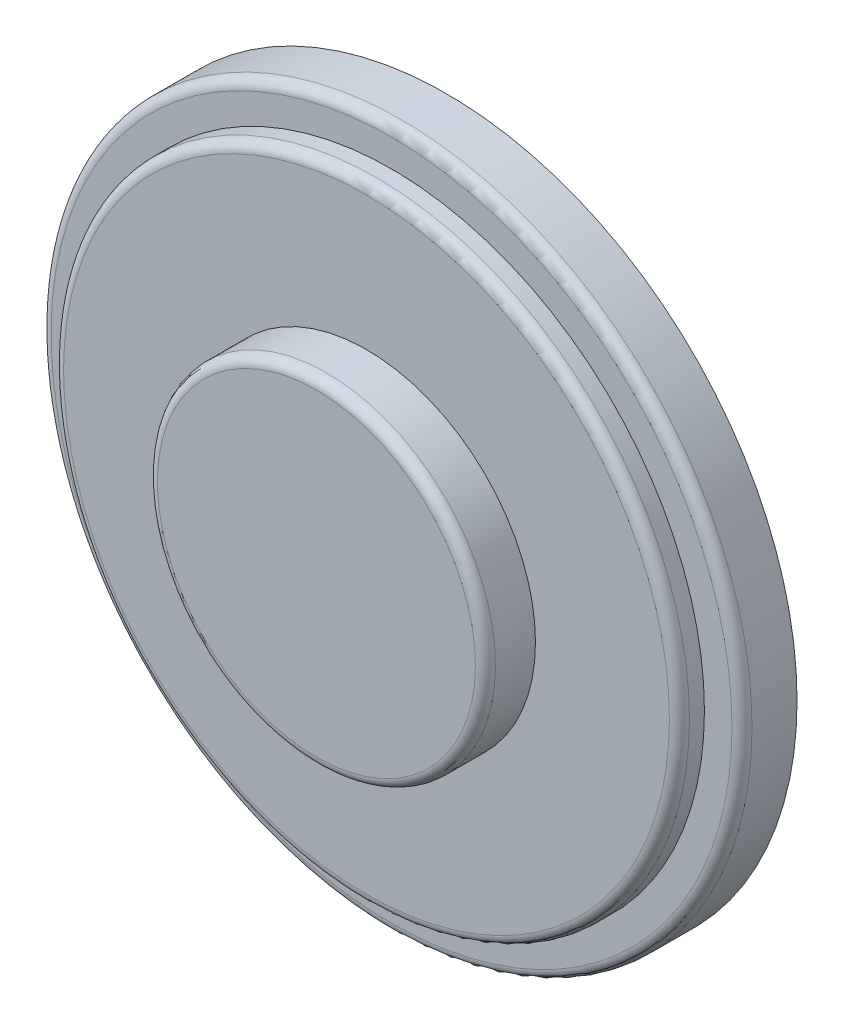
ISO-10303-21;
HEADER;
FILE_DESCRIPTION(('STEP AP214'),'2;1');
FILE_NAME('part.step','',(''),(''),'','','');
FILE_SCHEMA(('AUTOMOTIVE_DESIGN { 1 0 10303 214 1 1 1 1 }'));
ENDSEC;
DATA;
#1=APPLICATION_CONTEXT('core data for automotive mechanical design processes');
#2=APPLICATION_PROTOCOL_DEFINITION('international standard','automotive_design',2000,#1);
#3=PRODUCT_CONTEXT('',#1,'mechanical');
#4=PRODUCT('Part','Part','',(#3));
#5=PRODUCT_RELATED_PRODUCT_CATEGORY('part','',(#4));
#6=PRODUCT_DEFINITION_FORMATION('','',#4);
#7=PRODUCT_DEFINITION_CONTEXT('part definition',#1,'design');
#8=PRODUCT_DEFINITION('design','',#6,#7);
#9=PRODUCT_DEFINITION_SHAPE('','',#8);
#10=(LENGTH_UNIT() NAMED_UNIT(*) SI_UNIT(.MILLI.,.METRE.));
#11=(NAMED_UNIT(*) PLANE_ANGLE_UNIT() SI_UNIT($,.RADIAN.));
#12=(NAMED_UNIT(*) SI_UNIT($,.STERADIAN.) SOLID_ANGLE_UNIT());
#13=UNCERTAINTY_MEASURE_WITH_UNIT(LENGTH_MEASURE(1.E-05),#10,'distance_accuracy_value','');
#14=(GEOMETRIC_REPRESENTATION_CONTEXT(3) GLOBAL_UNCERTAINTY_ASSIGNED_CONTEXT((#13)) GLOBAL_UNIT_ASSIGNED_CONTEXT((#10,
#11,#12)) REPRESENTATION_CONTEXT('',''));
#15=CARTESIAN_POINT('',(0.,0.,0.));
#16=DIRECTION('',(0.,0.,1.));
#17=DIRECTION('',(1.,0.,0.));
#18=AXIS2_PLACEMENT_3D('',#15,#16,#17);
#19=CARTESIAN_POINT('',(0.,0.,2.2));
#20=DIRECTION('',(0.,0.,-1.));
#21=DIRECTION('',(-1.,0.,0.));
#22=AXIS2_PLACEMENT_3D('',#19,#20,#21);
#23=CYLINDRICAL_SURFACE('',#22,14.);
#24=CARTESIAN_POINT('',(0.,0.,1.8));
#25=DIRECTION('',(0.,0.,1.));
#26=DIRECTION('',(1.,0.,0.));
#27=AXIS2_PLACEMENT_3D('',#24,#25,#26);
#28=CIRCLE('',#27,14.);
#29=CARTESIAN_POINT('',(14.,0.,1.8));
#30=VERTEX_POINT('',#29);
#31=EDGE_CURVE('E52',#30,#30,#28,.F.);
#32=ORIENTED_EDGE('',*,*,#31,.T.);
#33=EDGE_LOOP('',(#32));
#34=FACE_BOUND('',#33,.T.);
#35=CARTESIAN_POINT('',(0.,0.,0.));
#36=DIRECTION('',(0.,0.,1.));
#37=DIRECTION('',(1.,0.,0.));
#38=AXIS2_PLACEMENT_3D('',#35,#36,#37);
#39=CIRCLE('',#38,14.);
#40=CARTESIAN_POINT('',(14.,0.,0.));
#41=VERTEX_POINT('',#40);
#42=EDGE_CURVE('E58',#41,#41,#39,.T.);
#43=ORIENTED_EDGE('',*,*,#42,.T.);
#44=EDGE_LOOP('',(#43));
#45=FACE_BOUND('',#44,.T.);
#46=ADVANCED_FACE('F32',(#34,#45),#23,.T.);
#47=CARTESIAN_POINT('',(0.,0.,2.2));
#48=DIRECTION('',(0.,0.,1.));
#49=DIRECTION('',(1.,0.,0.));
#50=AXIS2_PLACEMENT_3D('',#47,#48,#49);
#51=PLANE('',#50);
#52=CARTESIAN_POINT('',(0.,0.,2.2));
#53=DIRECTION('',(0.,0.,1.));
#54=DIRECTION('',(1.,0.,0.));
#55=AXIS2_PLACEMENT_3D('',#52,#53,#54);
#56=CIRCLE('',#55,13.6);
#57=CARTESIAN_POINT('',(13.6,0.,2.2));
#58=VERTEX_POINT('',#57);
#59=EDGE_CURVE('E55',#58,#58,#56,.T.);
#60=ORIENTED_EDGE('',*,*,#59,.T.);
#61=EDGE_LOOP('',(#60));
#62=FACE_BOUND('',#61,.T.);
#63=CARTESIAN_POINT('',(0.,0.,2.2));
#64=DIRECTION('',(0.,0.,1.));
#65=DIRECTION('',(1.,0.,0.));
#66=AXIS2_PLACEMENT_3D('',#63,#64,#65);
#67=CIRCLE('',#66,12.5);
#68=CARTESIAN_POINT('',(12.5,0.,2.2));
#69=VERTEX_POINT('',#68);
#70=EDGE_CURVE('E62',#69,#69,#67,.F.);
#71=ORIENTED_EDGE('',*,*,#70,.T.);
#72=EDGE_LOOP('',(#71));
#73=FACE_BOUND('',#72,.T.);
#74=ADVANCED_FACE('F68',(#62,#73),#51,.T.);
#75=CARTESIAN_POINT('',(0.,0.,0.));
#76=DIRECTION('',(0.,0.,1.));
#77=DIRECTION('',(1.,0.,0.));
#78=AXIS2_PLACEMENT_3D('',#75,#76,#77);
#79=PLANE('',#78);
#80=ORIENTED_EDGE('',*,*,#42,.F.);
#81=EDGE_LOOP('',(#80));
#82=FACE_BOUND('',#81,.T.);
#83=ADVANCED_FACE('F73',(#82),#79,.F.);
#84=CARTESIAN_POINT('',(0.,0.,3.2));
#85=DIRECTION('',(0.,0.,-1.));
#86=DIRECTION('',(-1.,0.,0.));
#87=AXIS2_PLACEMENT_3D('',#84,#85,#86);
#88=CYLINDRICAL_SURFACE('',#87,12.5);
#89=CARTESIAN_POINT('',(0.,0.,2.8));
#90=DIRECTION('',(0.,0.,1.));
#91=DIRECTION('',(1.,0.,0.));
#92=AXIS2_PLACEMENT_3D('',#89,#90,#91);
#93=CIRCLE('',#92,12.5);
#94=CARTESIAN_POINT('',(12.5,0.,2.8));
#95=VERTEX_POINT('',#94);
#96=EDGE_CURVE('E43',#95,#95,#93,.F.);
#97=ORIENTED_EDGE('',*,*,#96,.T.);
#98=EDGE_LOOP('',(#97));
#99=FACE_BOUND('',#98,.T.);
#100=ORIENTED_EDGE('',*,*,#70,.F.);
#101=EDGE_LOOP('',(#100));
#102=FACE_BOUND('',#101,.T.);
#103=ADVANCED_FACE('F70',(#99,#102),#88,.T.);
#104=CARTESIAN_POINT('',(0.,0.,3.2));
#105=DIRECTION('',(0.,0.,1.));
#106=DIRECTION('',(1.,0.,0.));
#107=AXIS2_PLACEMENT_3D('',#104,#105,#106);
#108=PLANE('',#107);
#109=CARTESIAN_POINT('',(0.,0.,3.2));
#110=DIRECTION('',(0.,0.,1.));
#111=DIRECTION('',(1.,0.,0.));
#112=AXIS2_PLACEMENT_3D('',#109,#110,#111);
#113=CIRCLE('',#112,12.1);
#114=CARTESIAN_POINT('',(12.1,0.,3.2));
#115=VERTEX_POINT('',#114);
#116=EDGE_CURVE('E47',#115,#115,#113,.T.);
#117=ORIENTED_EDGE('',*,*,#116,.T.);
#118=EDGE_LOOP('',(#117));
#119=FACE_BOUND('',#118,.T.);
#120=CARTESIAN_POINT('',(0.,0.,3.2));
#121=DIRECTION('',(0.,0.,1.));
#122=DIRECTION('',(1.,0.,0.));
#123=AXIS2_PLACEMENT_3D('',#120,#121,#122);
#124=CIRCLE('',#123,6.75);
#125=CARTESIAN_POINT('',(6.75,0.,3.2));
#126=VERTEX_POINT('',#125);
#127=EDGE_CURVE('E59',#126,#126,#124,.F.);
#128=ORIENTED_EDGE('',*,*,#127,.T.);
#129=EDGE_LOOP('',(#128));
#130=FACE_BOUND('',#129,.T.);
#131=ADVANCED_FACE('F72',(#119,#130),#108,.T.);
#132=CARTESIAN_POINT('',(0.,0.,5.2));
#133=DIRECTION('',(0.,0.,-1.));
#134=DIRECTION('',(-1.,0.,0.));
#135=AXIS2_PLACEMENT_3D('',#132,#133,#134);
#136=CYLINDRICAL_SURFACE('',#135,6.75);
#137=CARTESIAN_POINT('',(0.,0.,4.8));
#138=DIRECTION('',(0.,0.,1.));
#139=DIRECTION('',(1.,0.,0.));
#140=AXIS2_PLACEMENT_3D('',#137,#138,#139);
#141=CIRCLE('',#140,6.75);
#142=CARTESIAN_POINT('',(6.75,0.,4.8));
#143=VERTEX_POINT('',#142);
#144=EDGE_CURVE('E10',#143,#143,#141,.F.);
#145=ORIENTED_EDGE('',*,*,#144,.T.);
#146=EDGE_LOOP('',(#145));
#147=FACE_BOUND('',#146,.T.);
#148=ORIENTED_EDGE('',*,*,#127,.F.);
#149=EDGE_LOOP('',(#148));
#150=FACE_BOUND('',#149,.T.);
#151=ADVANCED_FACE('F80',(#147,#150),#136,.T.);
#152=CARTESIAN_POINT('',(0.,0.,5.2));
#153=DIRECTION('',(0.,0.,1.));
#154=DIRECTION('',(1.,0.,0.));
#155=AXIS2_PLACEMENT_3D('',#152,#153,#154);
#156=PLANE('',#155);
#157=CARTESIAN_POINT('',(0.,0.,5.2));
#158=DIRECTION('',(0.,0.,1.));
#159=DIRECTION('',(1.,0.,0.));
#160=AXIS2_PLACEMENT_3D('',#157,#158,#159);
#161=CIRCLE('',#160,6.35);
#162=CARTESIAN_POINT('',(6.35,0.,5.2));
#163=VERTEX_POINT('',#162);
#164=EDGE_CURVE('E39',#163,#163,#161,.T.);
#165=ORIENTED_EDGE('',*,*,#164,.T.);
#166=EDGE_LOOP('',(#165));
#167=FACE_BOUND('',#166,.T.);
#168=ADVANCED_FACE('F98',(#167),#156,.T.);
#169=CARTESIAN_POINT('',(0.,0.,1.8));
#170=DIRECTION('',(0.,0.,1.));
#171=DIRECTION('',(1.,0.,0.));
#172=AXIS2_PLACEMENT_3D('',#169,#170,#171);
#173=TOROIDAL_SURFACE('',#172,13.6,0.4);
#174=ORIENTED_EDGE('',*,*,#31,.F.);
#175=EDGE_LOOP('',(#174));
#176=FACE_BOUND('',#175,.T.);
#177=ORIENTED_EDGE('',*,*,#59,.F.);
#178=EDGE_LOOP('',(#177));
#179=FACE_BOUND('',#178,.T.);
#180=ADVANCED_FACE('F95',(#176,#179),#173,.T.);
#181=CARTESIAN_POINT('',(0.,0.,2.8));
#182=DIRECTION('',(0.,0.,1.));
#183=DIRECTION('',(1.,0.,0.));
#184=AXIS2_PLACEMENT_3D('',#181,#182,#183);
#185=TOROIDAL_SURFACE('',#184,12.1,0.4);
#186=ORIENTED_EDGE('',*,*,#96,.F.);
#187=EDGE_LOOP('',(#186));
#188=FACE_BOUND('',#187,.T.);
#189=ORIENTED_EDGE('',*,*,#116,.F.);
#190=EDGE_LOOP('',(#189));
#191=FACE_BOUND('',#190,.T.);
#192=ADVANCED_FACE('F97',(#188,#191),#185,.T.);
#193=CARTESIAN_POINT('',(0.,0.,4.8));
#194=DIRECTION('',(0.,0.,1.));
#195=DIRECTION('',(1.,0.,0.));
#196=AXIS2_PLACEMENT_3D('',#193,#194,#195);
#197=TOROIDAL_SURFACE('',#196,6.35,0.4);
#198=ORIENTED_EDGE('',*,*,#144,.F.);
#199=EDGE_LOOP('',(#198));
#200=FACE_BOUND('',#199,.T.);
#201=ORIENTED_EDGE('',*,*,#164,.F.);
#202=EDGE_LOOP('',(#201));
#203=FACE_BOUND('',#202,.T.);
#204=ADVANCED_FACE('F34',(#200,#203),#197,.T.);
#205=CLOSED_SHELL('',(#46,#74,#83,#103,#131,#151,#168,#180,#192,#204));
#206=MANIFOLD_SOLID_BREP('B2',#205);
#207=ADVANCED_BREP_SHAPE_REPRESENTATION('',(#18,#206),#14);
#208=SHAPE_DEFINITION_REPRESENTATION(#9,#207);
ENDSEC;
END-ISO-10303-21;
